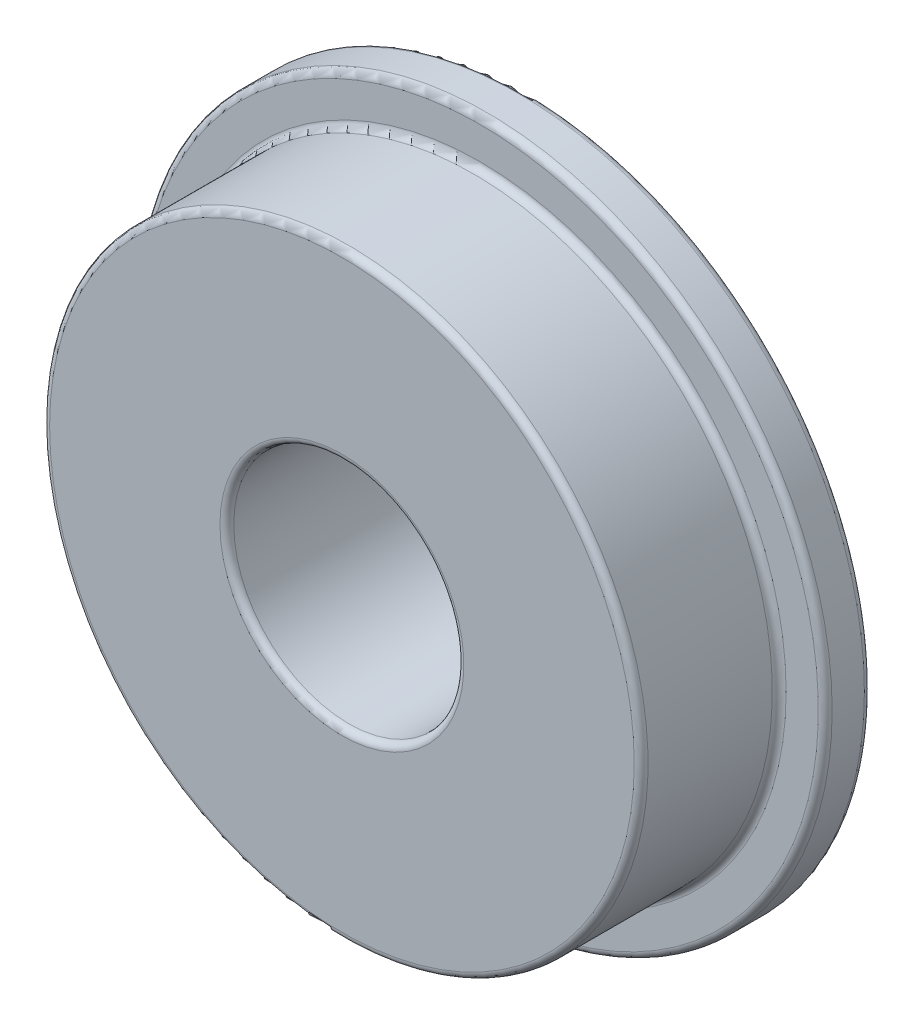
ISO-10303-21;
HEADER;
FILE_DESCRIPTION(('STEP AP214'),'2;1');
FILE_NAME('part.step','',(''),(''),'','','');
FILE_SCHEMA(('AUTOMOTIVE_DESIGN { 1 0 10303 214 1 1 1 1 }'));
ENDSEC;
DATA;
#1=APPLICATION_CONTEXT('core data for automotive mechanical design processes');
#2=APPLICATION_PROTOCOL_DEFINITION('international standard','automotive_design',2000,#1);
#3=PRODUCT_CONTEXT('',#1,'mechanical');
#4=PRODUCT('Part','Part','',(#3));
#5=PRODUCT_RELATED_PRODUCT_CATEGORY('part','',(#4));
#6=PRODUCT_DEFINITION_FORMATION('','',#4);
#7=PRODUCT_DEFINITION_CONTEXT('part definition',#1,'design');
#8=PRODUCT_DEFINITION('design','',#6,#7);
#9=PRODUCT_DEFINITION_SHAPE('','',#8);
#10=(LENGTH_UNIT() NAMED_UNIT(*) SI_UNIT(.MILLI.,.METRE.));
#11=(NAMED_UNIT(*) PLANE_ANGLE_UNIT() SI_UNIT($,.RADIAN.));
#12=(NAMED_UNIT(*) SI_UNIT($,.STERADIAN.) SOLID_ANGLE_UNIT());
#13=UNCERTAINTY_MEASURE_WITH_UNIT(LENGTH_MEASURE(1.E-05),#10,'distance_accuracy_value','');
#14=(GEOMETRIC_REPRESENTATION_CONTEXT(3) GLOBAL_UNCERTAINTY_ASSIGNED_CONTEXT((#13)) GLOBAL_UNIT_ASSIGNED_CONTEXT((#10,
#11,#12)) REPRESENTATION_CONTEXT('',''));
#15=CARTESIAN_POINT('',(0.,0.,0.));
#16=DIRECTION('',(0.,0.,1.));
#17=DIRECTION('',(1.,0.,0.));
#18=AXIS2_PLACEMENT_3D('',#15,#16,#17);
#19=CARTESIAN_POINT('',(0.,0.,-0.15));
#20=DIRECTION('',(0.,0.,-1.));
#21=DIRECTION('',(-1.,0.,0.));
#22=AXIS2_PLACEMENT_3D('',#19,#20,#21);
#23=TOROIDAL_SURFACE('',#22,2.65,0.15);
#24=CARTESIAN_POINT('',(0.,0.,-0.15));
#25=DIRECTION('',(0.,0.,-1.));
#26=DIRECTION('',(-1.,0.,0.));
#27=AXIS2_PLACEMENT_3D('',#24,#25,#26);
#28=CIRCLE('',#27,2.5);
#29=CARTESIAN_POINT('',(-2.5,0.,-0.15));
#30=VERTEX_POINT('',#29);
#31=EDGE_CURVE('E71',#30,#30,#28,.T.);
#32=ORIENTED_EDGE('',*,*,#31,.T.);
#33=EDGE_LOOP('',(#32));
#34=FACE_BOUND('',#33,.T.);
#35=CARTESIAN_POINT('',(0.,0.,0.));
#36=DIRECTION('',(0.,0.,-1.));
#37=DIRECTION('',(-1.,0.,0.));
#38=AXIS2_PLACEMENT_3D('',#35,#36,#37);
#39=CIRCLE('',#38,2.65);
#40=CARTESIAN_POINT('',(-2.65,0.,0.));
#41=VERTEX_POINT('',#40);
#42=EDGE_CURVE('E10',#41,#41,#39,.T.);
#43=ORIENTED_EDGE('',*,*,#42,.F.);
#44=EDGE_LOOP('',(#43));
#45=FACE_BOUND('',#44,.T.);
#46=ADVANCED_FACE('F31',(#34,#45),#23,.T.);
#47=CARTESIAN_POINT('',(0.,6.35,0.));
#48=DIRECTION('',(0.,0.,1.));
#49=DIRECTION('',(1.,0.,0.));
#50=AXIS2_PLACEMENT_3D('',#47,#48,#49);
#51=PLANE('',#50);
#52=ORIENTED_EDGE('',*,*,#42,.T.);
#53=EDGE_LOOP('',(#52));
#54=FACE_BOUND('',#53,.T.);
#55=CARTESIAN_POINT('',(0.,0.,0.));
#56=DIRECTION('',(0.,0.,-1.));
#57=DIRECTION('',(-1.,0.,0.));
#58=AXIS2_PLACEMENT_3D('',#55,#56,#57);
#59=CIRCLE('',#58,6.35);
#60=CARTESIAN_POINT('',(-6.35,0.,0.));
#61=VERTEX_POINT('',#60);
#62=EDGE_CURVE('E37',#61,#61,#59,.T.);
#63=ORIENTED_EDGE('',*,*,#62,.F.);
#64=EDGE_LOOP('',(#63));
#65=FACE_BOUND('',#64,.T.);
#66=ADVANCED_FACE('F89',(#54,#65),#51,.T.);
#67=CARTESIAN_POINT('',(0.,0.,-0.15));
#68=DIRECTION('',(0.,0.,-1.));
#69=DIRECTION('',(-1.,0.,0.));
#70=AXIS2_PLACEMENT_3D('',#67,#68,#69);
#71=TOROIDAL_SURFACE('',#70,6.35,0.15);
#72=ORIENTED_EDGE('',*,*,#62,.T.);
#73=EDGE_LOOP('',(#72));
#74=FACE_BOUND('',#73,.T.);
#75=CARTESIAN_POINT('',(0.,0.,-0.15));
#76=DIRECTION('',(0.,0.,-1.));
#77=DIRECTION('',(-1.,0.,0.));
#78=AXIS2_PLACEMENT_3D('',#75,#76,#77);
#79=CIRCLE('',#78,6.5);
#80=CARTESIAN_POINT('',(-6.5,0.,-0.15));
#81=VERTEX_POINT('',#80);
#82=EDGE_CURVE('E41',#81,#81,#79,.T.);
#83=ORIENTED_EDGE('',*,*,#82,.F.);
#84=EDGE_LOOP('',(#83));
#85=FACE_BOUND('',#84,.T.);
#86=ADVANCED_FACE('F93',(#74,#85),#71,.T.);
#87=CARTESIAN_POINT('',(0.,0.,0.));
#88=DIRECTION('',(0.,0.,-1.));
#89=DIRECTION('',(-1.,0.,0.));
#90=AXIS2_PLACEMENT_3D('',#87,#88,#89);
#91=CYLINDRICAL_SURFACE('',#90,6.5);
#92=ORIENTED_EDGE('',*,*,#82,.T.);
#93=EDGE_LOOP('',(#92));
#94=FACE_BOUND('',#93,.T.);
#95=CARTESIAN_POINT('',(0.,0.,-2.85));
#96=DIRECTION('',(0.,0.,-1.));
#97=DIRECTION('',(-1.,0.,0.));
#98=AXIS2_PLACEMENT_3D('',#95,#96,#97);
#99=CIRCLE('',#98,6.5);
#100=CARTESIAN_POINT('',(-6.5,0.,-2.85));
#101=VERTEX_POINT('',#100);
#102=EDGE_CURVE('E45',#101,#101,#99,.T.);
#103=ORIENTED_EDGE('',*,*,#102,.F.);
#104=EDGE_LOOP('',(#103));
#105=FACE_BOUND('',#104,.T.);
#106=ADVANCED_FACE('F97',(#94,#105),#91,.T.);
#107=CARTESIAN_POINT('',(0.,0.,-2.85));
#108=DIRECTION('',(0.,0.,-1.));
#109=DIRECTION('',(-1.,0.,0.));
#110=AXIS2_PLACEMENT_3D('',#107,#108,#109);
#111=TOROIDAL_SURFACE('',#110,6.65,0.15);
#112=ORIENTED_EDGE('',*,*,#102,.T.);
#113=EDGE_LOOP('',(#112));
#114=FACE_BOUND('',#113,.T.);
#115=CARTESIAN_POINT('',(0.,0.,-3.));
#116=DIRECTION('',(0.,0.,-1.));
#117=DIRECTION('',(-1.,0.,0.));
#118=AXIS2_PLACEMENT_3D('',#115,#116,#117);
#119=CIRCLE('',#118,6.65);
#120=CARTESIAN_POINT('',(-6.65,0.,-3.));
#121=VERTEX_POINT('',#120);
#122=EDGE_CURVE('E50',#121,#121,#119,.T.);
#123=ORIENTED_EDGE('',*,*,#122,.F.);
#124=EDGE_LOOP('',(#123));
#125=FACE_BOUND('',#124,.T.);
#126=ADVANCED_FACE('F103',(#114,#125),#111,.F.);
#127=CARTESIAN_POINT('',(0.,7.35,-3.));
#128=DIRECTION('',(0.,0.,1.));
#129=DIRECTION('',(1.,0.,0.));
#130=AXIS2_PLACEMENT_3D('',#127,#128,#129);
#131=PLANE('',#130);
#132=ORIENTED_EDGE('',*,*,#122,.T.);
#133=EDGE_LOOP('',(#132));
#134=FACE_BOUND('',#133,.T.);
#135=CARTESIAN_POINT('',(0.,0.,-3.));
#136=DIRECTION('',(0.,0.,-1.));
#137=DIRECTION('',(-1.,0.,0.));
#138=AXIS2_PLACEMENT_3D('',#135,#136,#137);
#139=CIRCLE('',#138,7.35);
#140=CARTESIAN_POINT('',(-7.35,0.,-3.));
#141=VERTEX_POINT('',#140);
#142=EDGE_CURVE('E53',#141,#141,#139,.T.);
#143=ORIENTED_EDGE('',*,*,#142,.F.);
#144=EDGE_LOOP('',(#143));
#145=FACE_BOUND('',#144,.T.);
#146=ADVANCED_FACE('F107',(#134,#145),#131,.T.);
#147=CARTESIAN_POINT('',(0.,0.,-3.15));
#148=DIRECTION('',(0.,0.,-1.));
#149=DIRECTION('',(-1.,0.,0.));
#150=AXIS2_PLACEMENT_3D('',#147,#148,#149);
#151=TOROIDAL_SURFACE('',#150,7.35,0.15);
#152=ORIENTED_EDGE('',*,*,#142,.T.);
#153=EDGE_LOOP('',(#152));
#154=FACE_BOUND('',#153,.T.);
#155=CARTESIAN_POINT('',(0.,0.,-3.15));
#156=DIRECTION('',(0.,0.,-1.));
#157=DIRECTION('',(-1.,0.,0.));
#158=AXIS2_PLACEMENT_3D('',#155,#156,#157);
#159=CIRCLE('',#158,7.5);
#160=CARTESIAN_POINT('',(-7.5,0.,-3.15));
#161=VERTEX_POINT('',#160);
#162=EDGE_CURVE('E56',#161,#161,#159,.T.);
#163=ORIENTED_EDGE('',*,*,#162,.F.);
#164=EDGE_LOOP('',(#163));
#165=FACE_BOUND('',#164,.T.);
#166=ADVANCED_FACE('F111',(#154,#165),#151,.T.);
#167=CARTESIAN_POINT('',(0.,0.,0.));
#168=DIRECTION('',(0.,0.,-1.));
#169=DIRECTION('',(-1.,0.,0.));
#170=AXIS2_PLACEMENT_3D('',#167,#168,#169);
#171=CYLINDRICAL_SURFACE('',#170,7.5);
#172=ORIENTED_EDGE('',*,*,#162,.T.);
#173=EDGE_LOOP('',(#172));
#174=FACE_BOUND('',#173,.T.);
#175=CARTESIAN_POINT('',(0.,0.,-3.85));
#176=DIRECTION('',(0.,0.,-1.));
#177=DIRECTION('',(-1.,0.,0.));
#178=AXIS2_PLACEMENT_3D('',#175,#176,#177);
#179=CIRCLE('',#178,7.5);
#180=CARTESIAN_POINT('',(-7.5,0.,-3.85));
#181=VERTEX_POINT('',#180);
#182=EDGE_CURVE('E59',#181,#181,#179,.T.);
#183=ORIENTED_EDGE('',*,*,#182,.F.);
#184=EDGE_LOOP('',(#183));
#185=FACE_BOUND('',#184,.T.);
#186=ADVANCED_FACE('F115',(#174,#185),#171,.T.);
#187=CARTESIAN_POINT('',(0.,0.,-3.85));
#188=DIRECTION('',(0.,0.,-1.));
#189=DIRECTION('',(-1.,0.,0.));
#190=AXIS2_PLACEMENT_3D('',#187,#188,#189);
#191=TOROIDAL_SURFACE('',#190,7.35,0.15);
#192=ORIENTED_EDGE('',*,*,#182,.T.);
#193=EDGE_LOOP('',(#192));
#194=FACE_BOUND('',#193,.T.);
#195=CARTESIAN_POINT('',(0.,0.,-4.));
#196=DIRECTION('',(0.,0.,-1.));
#197=DIRECTION('',(-1.,0.,0.));
#198=AXIS2_PLACEMENT_3D('',#195,#196,#197);
#199=CIRCLE('',#198,7.35);
#200=CARTESIAN_POINT('',(-7.35,0.,-4.));
#201=VERTEX_POINT('',#200);
#202=EDGE_CURVE('E62',#201,#201,#199,.T.);
#203=ORIENTED_EDGE('',*,*,#202,.F.);
#204=EDGE_LOOP('',(#203));
#205=FACE_BOUND('',#204,.T.);
#206=ADVANCED_FACE('F119',(#194,#205),#191,.T.);
#207=CARTESIAN_POINT('',(0.,2.65,-4.));
#208=DIRECTION('',(0.,0.,-1.));
#209=DIRECTION('',(-1.,0.,0.));
#210=AXIS2_PLACEMENT_3D('',#207,#208,#209);
#211=PLANE('',#210);
#212=ORIENTED_EDGE('',*,*,#202,.T.);
#213=EDGE_LOOP('',(#212));
#214=FACE_BOUND('',#213,.T.);
#215=CARTESIAN_POINT('',(0.,0.,-4.));
#216=DIRECTION('',(0.,0.,-1.));
#217=DIRECTION('',(-1.,0.,0.));
#218=AXIS2_PLACEMENT_3D('',#215,#216,#217);
#219=CIRCLE('',#218,2.65);
#220=CARTESIAN_POINT('',(-2.65,0.,-4.));
#221=VERTEX_POINT('',#220);
#222=EDGE_CURVE('E65',#221,#221,#219,.T.);
#223=ORIENTED_EDGE('',*,*,#222,.F.);
#224=EDGE_LOOP('',(#223));
#225=FACE_BOUND('',#224,.T.);
#226=ADVANCED_FACE('F85',(#214,#225),#211,.T.);
#227=CARTESIAN_POINT('',(0.,0.,-3.85));
#228=DIRECTION('',(0.,0.,-1.));
#229=DIRECTION('',(-1.,0.,0.));
#230=AXIS2_PLACEMENT_3D('',#227,#228,#229);
#231=TOROIDAL_SURFACE('',#230,2.65,0.149999999999999);
#232=ORIENTED_EDGE('',*,*,#222,.T.);
#233=EDGE_LOOP('',(#232));
#234=FACE_BOUND('',#233,.T.);
#235=CARTESIAN_POINT('',(0.,0.,-3.85));
#236=DIRECTION('',(0.,0.,-1.));
#237=DIRECTION('',(-1.,0.,0.));
#238=AXIS2_PLACEMENT_3D('',#235,#236,#237);
#239=CIRCLE('',#238,2.5);
#240=CARTESIAN_POINT('',(-2.5,0.,-3.85));
#241=VERTEX_POINT('',#240);
#242=EDGE_CURVE('E68',#241,#241,#239,.T.);
#243=ORIENTED_EDGE('',*,*,#242,.F.);
#244=EDGE_LOOP('',(#243));
#245=FACE_BOUND('',#244,.T.);
#246=ADVANCED_FACE('F79',(#234,#245),#231,.T.);
#247=CARTESIAN_POINT('',(0.,0.,0.));
#248=DIRECTION('',(0.,0.,-1.));
#249=DIRECTION('',(-1.,0.,0.));
#250=AXIS2_PLACEMENT_3D('',#247,#248,#249);
#251=CYLINDRICAL_SURFACE('',#250,2.5);
#252=ORIENTED_EDGE('',*,*,#242,.T.);
#253=EDGE_LOOP('',(#252));
#254=FACE_BOUND('',#253,.T.);
#255=ORIENTED_EDGE('',*,*,#31,.F.);
#256=EDGE_LOOP('',(#255));
#257=FACE_BOUND('',#256,.T.);
#258=ADVANCED_FACE('F77',(#254,#257),#251,.F.);
#259=CLOSED_SHELL('',(#46,#66,#86,#106,#126,#146,#166,#186,#206,#226,#246,#258));
#260=MANIFOLD_SOLID_BREP('B2',#259);
#261=ADVANCED_BREP_SHAPE_REPRESENTATION('',(#18,#260),#14);
#262=SHAPE_DEFINITION_REPRESENTATION(#9,#261);
ENDSEC;
END-ISO-10303-21;
